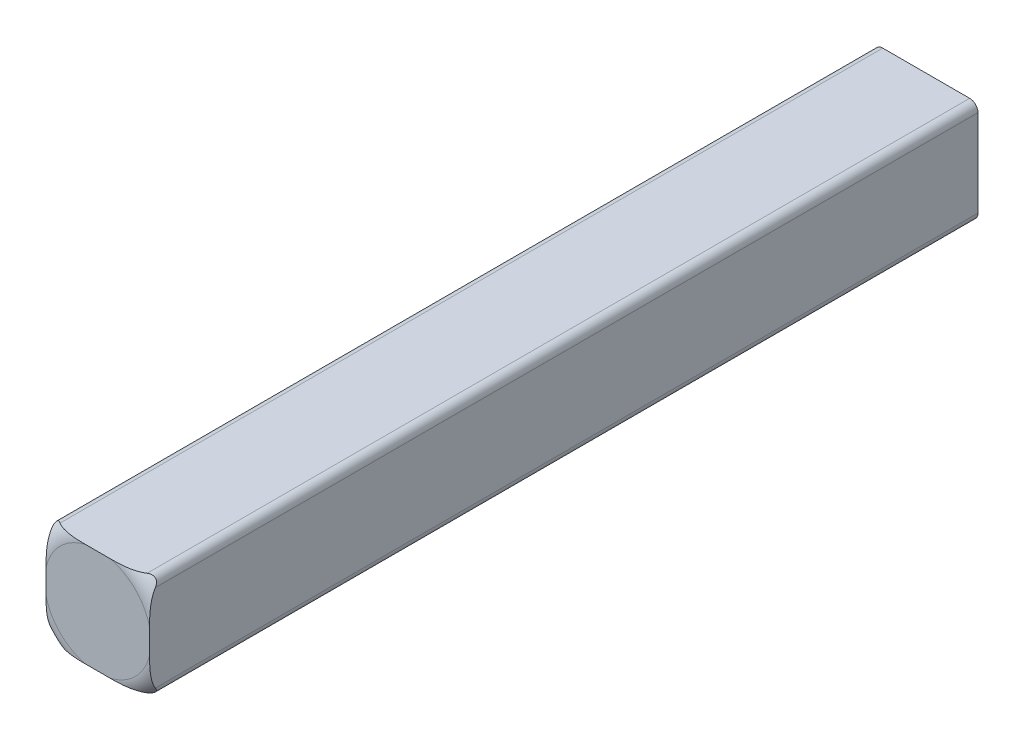
ISO-10303-21;
HEADER;
FILE_DESCRIPTION(('STEP AP214'),'2;1');
FILE_NAME('part.step','',(''),(''),'','','');
FILE_SCHEMA(('AUTOMOTIVE_DESIGN { 1 0 10303 214 1 1 1 1 }'));
ENDSEC;
DATA;
#1=APPLICATION_CONTEXT('core data for automotive mechanical design processes');
#2=APPLICATION_PROTOCOL_DEFINITION('international standard','automotive_design',2000,#1);
#3=PRODUCT_CONTEXT('',#1,'mechanical');
#4=PRODUCT('Part','Part','',(#3));
#5=PRODUCT_RELATED_PRODUCT_CATEGORY('part','',(#4));
#6=PRODUCT_DEFINITION_FORMATION('','',#4);
#7=PRODUCT_DEFINITION_CONTEXT('part definition',#1,'design');
#8=PRODUCT_DEFINITION('design','',#6,#7);
#9=PRODUCT_DEFINITION_SHAPE('','',#8);
#10=(LENGTH_UNIT() NAMED_UNIT(*) SI_UNIT(.MILLI.,.METRE.));
#11=(NAMED_UNIT(*) PLANE_ANGLE_UNIT() SI_UNIT($,.RADIAN.));
#12=(NAMED_UNIT(*) SI_UNIT($,.STERADIAN.) SOLID_ANGLE_UNIT());
#13=UNCERTAINTY_MEASURE_WITH_UNIT(LENGTH_MEASURE(1.E-05),#10,'distance_accuracy_value','');
#14=(GEOMETRIC_REPRESENTATION_CONTEXT(3) GLOBAL_UNCERTAINTY_ASSIGNED_CONTEXT((#13)) GLOBAL_UNIT_ASSIGNED_CONTEXT((#10,
#11,#12)) REPRESENTATION_CONTEXT('',''));
#15=CARTESIAN_POINT('',(0.,0.,0.));
#16=DIRECTION('',(0.,0.,1.));
#17=DIRECTION('',(1.,0.,0.));
#18=AXIS2_PLACEMENT_3D('',#15,#16,#17);
#19=CARTESIAN_POINT('',(-1.5875,1.5875,25.4));
#20=DIRECTION('',(0.,-1.,0.));
#21=DIRECTION('',(0.,0.,-1.));
#22=AXIS2_PLACEMENT_3D('',#19,#20,#21);
#23=PLANE('',#22);
#24=DIRECTION('',(1.,0.,0.));
#25=VECTOR('',#24,1.);
#26=CARTESIAN_POINT('',(-1.5875,1.5875,0.));
#27=LINE('',#26,#25);
#28=CARTESIAN_POINT('',(-1.33349999999988,1.5875,0.));
#29=VERTEX_POINT('',#28);
#30=CARTESIAN_POINT('',(1.33349999999988,1.5875,0.));
#31=VERTEX_POINT('',#30);
#32=EDGE_CURVE('E96',#29,#31,#27,.T.);
#33=ORIENTED_EDGE('',*,*,#32,.F.);
#34=DIRECTION('',(0.,0.,-1.));
#35=VECTOR('',#34,1.);
#36=CARTESIAN_POINT('',(-1.33350000000001,1.5875,25.4));
#37=LINE('',#36,#35);
#38=CARTESIAN_POINT('',(-1.33349999999976,1.58749999999933,25.2214993180163));
#39=VERTEX_POINT('',#38);
#40=EDGE_CURVE('E127',#39,#29,#37,.T.);
#41=ORIENTED_EDGE('',*,*,#40,.F.);
#42=CARTESIAN_POINT('',(-0.377876338243537,1.5875,25.4));
#43=CARTESIAN_POINT('',(-0.411612509119626,1.5875,25.3999933751559));
#44=CARTESIAN_POINT('',(-0.445352736805656,1.5875,25.3998557902654));
#45=CARTESIAN_POINT('',(-0.512942907948327,1.5875,25.3990478407271));
#46=CARTESIAN_POINT('',(-0.546792826939162,1.5875,25.3983756336304));
#47=CARTESIAN_POINT('',(-0.614509507764878,1.5875,25.3962226303108));
#48=CARTESIAN_POINT('',(-0.648376243547029,1.5875,25.3947408964801));
#49=CARTESIAN_POINT('',(-0.715189437993944,1.5875,25.3907056324485));
#50=CARTESIAN_POINT('',(-0.748137535690098,1.5875,25.3881801182269));
#51=CARTESIAN_POINT('',(-0.813874511250842,1.5875,25.3817497399492));
#52=CARTESIAN_POINT('',(-0.846663515341614,1.5875,25.3778462570928));
#53=CARTESIAN_POINT('',(-0.911972001446368,1.5875,25.3683282433345));
#54=CARTESIAN_POINT('',(-0.944491567482064,1.5875,25.3627142681786));
#55=CARTESIAN_POINT('',(-1.03884990510626,1.58750000000001,25.3432957352134));
#56=CARTESIAN_POINT('',(-1.10020590566776,1.58750000000004,25.326702751592));
#57=CARTESIAN_POINT('',(-1.17979261140478,1.58749999999999,25.297655047337));
#58=CARTESIAN_POINT('',(-1.19970518510336,1.58749999999997,25.2897223580693));
#59=CARTESIAN_POINT('',(-1.23899757921714,1.58750000000004,25.272570532428));
#60=CARTESIAN_POINT('',(-1.25837690634234,1.58750000000013,25.2633502498628));
#61=CARTESIAN_POINT('',(-1.29648737036626,1.58749999999987,25.243502020843));
#62=CARTESIAN_POINT('',(-1.31521592279952,1.58749999999952,25.232869126592));
#63=CARTESIAN_POINT('',(-1.3334999999995,1.58749999999867,25.2214993180167));
#64=B_SPLINE_CURVE_WITH_KNOTS('',3,(#42,#43,#44,#45,#46,#47,#48,#49,#50,#51,#52,#53,#54,#55,#56,
#57,#58,#59,#60,#61,#62,#63),.UNSPECIFIED.,.F.,.F.,(4,2,2,2,2,2,2,2,2,2,4),(0.,
0.101214578869633,0.202779489233488,0.304462283979966,0.403576841200485,0.502592332234144,
0.601575686961526,0.791402246158587,0.855672419606408,0.920000174261183,0.984559494506423),.UNSPECIFIED.);
#65=CARTESIAN_POINT('',(-0.377876338243537,1.5875,25.4));
#66=VERTEX_POINT('',#65);
#67=EDGE_CURVE('E88',#66,#39,#64,.T.);
#68=ORIENTED_EDGE('',*,*,#67,.F.);
#69=DIRECTION('',(-1.,0.,0.));
#70=VECTOR('',#69,1.);
#71=CARTESIAN_POINT('',(-1.5875,1.5875,25.4));
#72=LINE('',#71,#70);
#73=CARTESIAN_POINT('',(0.377876338243536,1.5875,25.4));
#74=VERTEX_POINT('',#73);
#75=EDGE_CURVE('E124',#66,#74,#72,.F.);
#76=ORIENTED_EDGE('',*,*,#75,.T.);
#77=CARTESIAN_POINT('',(1.3335,1.5875,25.2214993180159));
#78=CARTESIAN_POINT('',(1.31039310118339,1.5875,25.2358652995629));
#79=CARTESIAN_POINT('',(1.2865956642968,1.5875,25.2490482576007));
#80=CARTESIAN_POINT('',(1.23796868030271,1.5875,25.2732235603891));
#81=CARTESIAN_POINT('',(1.21314134560692,1.5875,25.284220334021));
#82=CARTESIAN_POINT('',(1.13821413543874,1.5875,25.313985593762));
#83=CARTESIAN_POINT('',(1.08698851455542,1.5875,25.3299288510369));
#84=CARTESIAN_POINT('',(0.999962751237763,1.5875,25.3515855860613));
#85=CARTESIAN_POINT('',(0.964535612837992,1.5875,25.3589398885291));
#86=CARTESIAN_POINT('',(0.893247688923865,1.5875,25.3713838801317));
#87=CARTESIAN_POINT('',(0.857386498395726,1.5875,25.3764712545345));
#88=CARTESIAN_POINT('',(0.785399533338706,1.5875,25.3848313870659));
#89=CARTESIAN_POINT('',(0.749273402082695,1.5875,25.3881009072115));
#90=CARTESIAN_POINT('',(0.675801730227447,1.5875,25.3933189638327));
#91=CARTESIAN_POINT('',(0.638453184386328,1.5875,25.3952232897935));
#92=CARTESIAN_POINT('',(0.563797247200004,1.5875,25.3979718892388));
#93=CARTESIAN_POINT('',(0.526489923948468,1.5875,25.3988182849851));
#94=CARTESIAN_POINT('',(0.452078339022183,1.5875,25.3998256272711));
#95=CARTESIAN_POINT('',(0.414974136365072,1.5875,25.3999904665671));
#96=CARTESIAN_POINT('',(0.377876338243536,1.5875,25.4));
#97=B_SPLINE_CURVE_WITH_KNOTS('',3,(#77,#78,#79,#80,#81,#82,#83,#84,#85,#86,#87,#88,#89,#90,#91,
#92,#93,#94,#95,#96),.UNSPECIFIED.,.F.,.F.,(4,2,2,2,2,2,2,2,2,4),(0.,0.0815326247959326,
0.162898354774419,0.323290286001704,0.431774886900757,0.540370007655983,0.649157944635816,
0.761326732026148,0.873270140095043,0.984573284944613),.UNSPECIFIED.);
#98=CARTESIAN_POINT('',(1.3335,1.5875,25.2214993180159));
#99=VERTEX_POINT('',#98);
#100=EDGE_CURVE('E168',#99,#74,#97,.T.);
#101=ORIENTED_EDGE('',*,*,#100,.F.);
#102=DIRECTION('',(0.,0.,-1.));
#103=VECTOR('',#102,1.);
#104=CARTESIAN_POINT('',(1.33350000000001,1.5875,25.4));
#105=LINE('',#104,#103);
#106=EDGE_CURVE('E167',#31,#99,#105,.F.);
#107=ORIENTED_EDGE('',*,*,#106,.F.);
#108=EDGE_LOOP('',(#33,#41,#68,#76,#101,#107));
#109=FACE_BOUND('',#108,.T.);
#110=ADVANCED_FACE('F34',(#109),#23,.F.);
#111=CARTESIAN_POINT('',(1.3335,1.3335,25.4));
#112=DIRECTION('',(0.,0.,-1.));
#113=DIRECTION('',(-1.,0.,0.));
#114=AXIS2_PLACEMENT_3D('',#111,#112,#113);
#115=CYLINDRICAL_SURFACE('',#114,0.254);
#116=DIRECTION('',(0.,0.,1.));
#117=VECTOR('',#116,1.);
#118=CARTESIAN_POINT('',(1.5875,1.33350000000001,25.4));
#119=LINE('',#118,#117);
#120=CARTESIAN_POINT('',(1.58749999999933,1.33349999999975,25.2214993180163));
#121=VERTEX_POINT('',#120);
#122=CARTESIAN_POINT('',(1.5875,1.33349999999988,0.));
#123=VERTEX_POINT('',#122);
#124=EDGE_CURVE('E490',#121,#123,#119,.F.);
#125=ORIENTED_EDGE('',*,*,#124,.T.);
#126=CARTESIAN_POINT('',(1.3335,1.3335,0.));
#127=DIRECTION('',(0.,0.,-1.));
#128=DIRECTION('',(-1.,0.,0.));
#129=AXIS2_PLACEMENT_3D('',#126,#127,#128);
#130=CIRCLE('',#129,0.254);
#131=EDGE_CURVE('E495',#123,#31,#130,.F.);
#132=ORIENTED_EDGE('',*,*,#131,.T.);
#133=ORIENTED_EDGE('',*,*,#106,.T.);
#134=CARTESIAN_POINT('',(1.3335,1.5875,25.2214993180159));
#135=CARTESIAN_POINT('',(1.34690792462913,1.58748566897288,25.2131902383444));
#136=CARTESIAN_POINT('',(1.36046268636274,1.58643563491714,25.2049732030893));
#137=CARTESIAN_POINT('',(1.38783838491251,1.58201648662521,25.1892469870888));
#138=CARTESIAN_POINT('',(1.40166046367848,1.57861670279278,25.1817486789985));
#139=CARTESIAN_POINT('',(1.42521880461481,1.57058714220896,25.1701813537226));
#140=CARTESIAN_POINT('',(1.43498690476737,1.56659229292943,25.1657462781291));
#141=CARTESIAN_POINT('',(1.45425932377618,1.55721249958346,25.1580014330523));
#142=CARTESIAN_POINT('',(1.46376466264463,1.55183414419047,25.1546864976667));
#143=CARTESIAN_POINT('',(1.48078992954893,1.54064277647373,25.1499494031102));
#144=CARTESIAN_POINT('',(1.48838416094885,1.53503704758616,25.1483092418591));
#145=CARTESIAN_POINT('',(1.50299443314631,1.52291375209377,25.1462529778718));
#146=CARTESIAN_POINT('',(1.51001060875297,1.51639639905189,25.1458365889481));
#147=CARTESIAN_POINT('',(1.52324184577942,1.50263078678935,25.1462804295973));
#148=CARTESIAN_POINT('',(1.52945667397997,1.49538231587763,25.1471410299099));
#149=CARTESIAN_POINT('',(1.54093535352862,1.48038761855588,25.1500339763629));
#150=CARTESIAN_POINT('',(1.54619862694723,1.47264109349685,25.1520670314777));
#151=CARTESIAN_POINT('',(1.5571701281181,1.45446300659162,25.157864814596));
#152=CARTESIAN_POINT('',(1.56252875091595,1.44392996611573,25.161967806468));
#153=CARTESIAN_POINT('',(1.57162418246107,1.42264994892329,25.1713367713514));
#154=CARTESIAN_POINT('',(1.57535394035416,1.41190224866778,25.1766076544231));
#155=CARTESIAN_POINT('',(1.58147222213898,1.38976321513482,25.1882192454684));
#156=CARTESIAN_POINT('',(1.58376977522872,1.37837092259128,25.1946044346479));
#157=CARTESIAN_POINT('',(1.58677095199112,1.35579141019531,25.2078013248425));
#158=CARTESIAN_POINT('',(1.58749208945789,1.34460332096515,25.2146074664251));
#159=CARTESIAN_POINT('',(1.5875,1.33350000000001,25.2214993180159));
#160=B_SPLINE_CURVE_WITH_KNOTS('',3,(#134,#135,#136,#137,#138,#139,#140,#141,#142,#143,#144,
#145,#146,#147,#148,#149,#150,#151,#152,#153,#154,#155,#156,#157,#158,#159),.UNSPECIFIED.,.F.,
.F.,(4,2,2,2,2,2,2,2,2,2,2,2,4),(0.,0.0474135575383169,0.0954579548320223,0.129685196647709,
0.163752362077401,0.192367952546184,0.220976850534823,0.249594055978005,0.278228584196804,
0.31555199042672,0.353035394369279,0.392706187180641,0.431933953270492),.UNSPECIFIED.);
#161=EDGE_CURVE('E154',#99,#121,#160,.T.);
#162=ORIENTED_EDGE('',*,*,#161,.T.);
#163=EDGE_LOOP('',(#125,#132,#133,#162));
#164=FACE_BOUND('',#163,.T.);
#165=ADVANCED_FACE('F170',(#164),#115,.T.);
#166=CARTESIAN_POINT('',(-1.3335,1.3335,25.4));
#167=DIRECTION('',(0.,0.,-1.));
#168=DIRECTION('',(-1.,0.,0.));
#169=AXIS2_PLACEMENT_3D('',#166,#167,#168);
#170=CYLINDRICAL_SURFACE('',#169,0.254);
#171=ORIENTED_EDGE('',*,*,#40,.T.);
#172=CARTESIAN_POINT('',(-1.3335,1.3335,0.));
#173=DIRECTION('',(0.,0.,-1.));
#174=DIRECTION('',(-1.,0.,0.));
#175=AXIS2_PLACEMENT_3D('',#172,#173,#174);
#176=CIRCLE('',#175,0.254);
#177=CARTESIAN_POINT('',(-1.5875,1.33349999999988,0.));
#178=VERTEX_POINT('',#177);
#179=EDGE_CURVE('E507',#29,#178,#176,.F.);
#180=ORIENTED_EDGE('',*,*,#179,.T.);
#181=DIRECTION('',(0.,0.,-1.));
#182=VECTOR('',#181,1.);
#183=CARTESIAN_POINT('',(-1.5875,1.33350000000001,25.4));
#184=LINE('',#183,#182);
#185=CARTESIAN_POINT('',(-1.5875,1.3335,25.2214993180159));
#186=VERTEX_POINT('',#185);
#187=EDGE_CURVE('E488',#178,#186,#184,.F.);
#188=ORIENTED_EDGE('',*,*,#187,.T.);
#189=CARTESIAN_POINT('',(-1.33350000000001,1.5875,25.2214993180159));
#190=CARTESIAN_POINT('',(-1.34690792462914,1.58748566897288,25.2131902383444));
#191=CARTESIAN_POINT('',(-1.36046268636275,1.58643563491714,25.2049732030893));
#192=CARTESIAN_POINT('',(-1.38783838491252,1.5820164866252,25.1892469870888));
#193=CARTESIAN_POINT('',(-1.40166046367848,1.57861670279278,25.1817486789985));
#194=CARTESIAN_POINT('',(-1.42521880461481,1.57058714220896,25.1701813537226));
#195=CARTESIAN_POINT('',(-1.43498690476738,1.56659229292943,25.1657462781291));
#196=CARTESIAN_POINT('',(-1.45425932377619,1.55721249958346,25.1580014330523));
#197=CARTESIAN_POINT('',(-1.46376466264463,1.55183414419047,25.1546864976667));
#198=CARTESIAN_POINT('',(-1.48078992954894,1.54064277647373,25.1499494031102));
#199=CARTESIAN_POINT('',(-1.48838416094885,1.53503704758616,25.1483092418591));
#200=CARTESIAN_POINT('',(-1.50299443314631,1.52291375209376,25.1462529778718));
#201=CARTESIAN_POINT('',(-1.51001060875298,1.51639639905189,25.1458365889481));
#202=CARTESIAN_POINT('',(-1.52324184577942,1.50263078678935,25.1462804295973));
#203=CARTESIAN_POINT('',(-1.52945667397998,1.49538231587763,25.1471410299099));
#204=CARTESIAN_POINT('',(-1.54093535352863,1.48038761855587,25.1500339763629));
#205=CARTESIAN_POINT('',(-1.54619862694723,1.47264109349684,25.1520670314777));
#206=CARTESIAN_POINT('',(-1.5571701281181,1.45446300659162,25.157864814596));
#207=CARTESIAN_POINT('',(-1.56252875091595,1.44392996611573,25.161967806468));
#208=CARTESIAN_POINT('',(-1.57162418246107,1.42264994892329,25.1713367713514));
#209=CARTESIAN_POINT('',(-1.57535394035416,1.41190224866778,25.1766076544231));
#210=CARTESIAN_POINT('',(-1.58147222213898,1.38976321513481,25.1882192454684));
#211=CARTESIAN_POINT('',(-1.58376977522872,1.37837092259127,25.1946044346479));
#212=CARTESIAN_POINT('',(-1.58677095199112,1.35579141019531,25.2078013248425));
#213=CARTESIAN_POINT('',(-1.58749208945789,1.34460332096514,25.2146074664251));
#214=CARTESIAN_POINT('',(-1.5875,1.3335,25.2214993180159));
#215=B_SPLINE_CURVE_WITH_KNOTS('',3,(#189,#190,#191,#192,#193,#194,#195,#196,#197,#198,#199,
#200,#201,#202,#203,#204,#205,#206,#207,#208,#209,#210,#211,#212,#213,#214),.UNSPECIFIED.,.F.,
.F.,(4,2,2,2,2,2,2,2,2,2,2,2,4),(0.,0.0474135575383122,0.0954579548320149,0.129685196647703,
0.163752362077395,0.192367952546178,0.220976850534816,0.249594055977996,0.278228584196794,
0.315551990426708,0.353035394369269,0.392706187180634,0.431933953270492),.UNSPECIFIED.);
#216=EDGE_CURVE('E129',#39,#186,#215,.T.);
#217=ORIENTED_EDGE('',*,*,#216,.F.);
#218=EDGE_LOOP('',(#171,#180,#188,#217));
#219=FACE_BOUND('',#218,.T.);
#220=ADVANCED_FACE('F313',(#219),#170,.T.);
#221=CARTESIAN_POINT('',(1.5875,-1.5875,25.4));
#222=DIRECTION('',(-1.,0.,0.));
#223=DIRECTION('',(0.,0.,1.));
#224=AXIS2_PLACEMENT_3D('',#221,#222,#223);
#225=PLANE('',#224);
#226=DIRECTION('',(0.,-1.,0.));
#227=VECTOR('',#226,1.);
#228=CARTESIAN_POINT('',(1.5875,-1.5875,0.));
#229=LINE('',#228,#227);
#230=CARTESIAN_POINT('',(1.5875,-1.33349999999988,0.));
#231=VERTEX_POINT('',#230);
#232=EDGE_CURVE('E508',#123,#231,#229,.T.);
#233=ORIENTED_EDGE('',*,*,#232,.F.);
#234=ORIENTED_EDGE('',*,*,#124,.F.);
#235=CARTESIAN_POINT('',(1.5875,0.377876338243537,25.4));
#236=CARTESIAN_POINT('',(1.5875,0.411612509119626,25.3999933751559));
#237=CARTESIAN_POINT('',(1.5875,0.445352736805657,25.3998557902654));
#238=CARTESIAN_POINT('',(1.5875,0.512942907948327,25.3990478407271));
#239=CARTESIAN_POINT('',(1.5875,0.546792826939163,25.3983756336304));
#240=CARTESIAN_POINT('',(1.5875,0.614509507764879,25.3962226303108));
#241=CARTESIAN_POINT('',(1.5875,0.64837624354703,25.3947408964801));
#242=CARTESIAN_POINT('',(1.5875,0.715189437993945,25.3907056324485));
#243=CARTESIAN_POINT('',(1.5875,0.7481375356901,25.3881801182269));
#244=CARTESIAN_POINT('',(1.5875,0.813874511250844,25.3817497399492));
#245=CARTESIAN_POINT('',(1.5875,0.846663515341615,25.3778462570928));
#246=CARTESIAN_POINT('',(1.5875,0.91197200144637,25.3683282433344));
#247=CARTESIAN_POINT('',(1.5875,0.944491567482066,25.3627142681786));
#248=CARTESIAN_POINT('',(1.58750000000001,1.03884990510626,25.3432957352134));
#249=CARTESIAN_POINT('',(1.58750000000004,1.10020590566776,25.326702751592));
#250=CARTESIAN_POINT('',(1.58749999999999,1.17979261140478,25.297655047337));
#251=CARTESIAN_POINT('',(1.58749999999997,1.19970518510336,25.2897223580693));
#252=CARTESIAN_POINT('',(1.58750000000004,1.23899757921714,25.272570532428));
#253=CARTESIAN_POINT('',(1.58750000000013,1.25837690634234,25.2633502498628));
#254=CARTESIAN_POINT('',(1.58749999999987,1.29648737036626,25.243502020843));
#255=CARTESIAN_POINT('',(1.58749999999952,1.31521592279952,25.232869126592));
#256=CARTESIAN_POINT('',(1.58749999999867,1.3334999999995,25.2214993180167));
#257=B_SPLINE_CURVE_WITH_KNOTS('',3,(#235,#236,#237,#238,#239,#240,#241,#242,#243,#244,#245,
#246,#247,#248,#249,#250,#251,#252,#253,#254,#255,#256),.UNSPECIFIED.,.F.,.F.,(4,2,2,2,2,2,2,2,
2,2,4),(0.,0.101214578869634,0.202779489233488,0.304462283979967,0.403576841200486,
0.502592332234146,0.601575686961527,0.791402246158587,0.855672419606407,0.920000174261181,
0.984559494506421),.UNSPECIFIED.);
#258=CARTESIAN_POINT('',(1.5875,0.377876338243537,25.4));
#259=VERTEX_POINT('',#258);
#260=EDGE_CURVE('E59',#259,#121,#257,.T.);
#261=ORIENTED_EDGE('',*,*,#260,.F.);
#262=DIRECTION('',(0.,1.,0.));
#263=VECTOR('',#262,1.);
#264=CARTESIAN_POINT('',(1.5875,1.5875,25.4));
#265=LINE('',#264,#263);
#266=CARTESIAN_POINT('',(1.5875,-0.377876338243537,25.4));
#267=VERTEX_POINT('',#266);
#268=EDGE_CURVE('E142',#259,#267,#265,.F.);
#269=ORIENTED_EDGE('',*,*,#268,.T.);
#270=CARTESIAN_POINT('',(1.5875,-1.3335,25.2214993180159));
#271=CARTESIAN_POINT('',(1.5875,-1.31039310118339,25.2358652995629));
#272=CARTESIAN_POINT('',(1.5875,-1.2865956642968,25.2490482576007));
#273=CARTESIAN_POINT('',(1.5875,-1.23796868030272,25.2732235603891));
#274=CARTESIAN_POINT('',(1.5875,-1.21314134560692,25.284220334021));
#275=CARTESIAN_POINT('',(1.5875,-1.13821413543874,25.313985593762));
#276=CARTESIAN_POINT('',(1.5875,-1.08698851455542,25.3299288510369));
#277=CARTESIAN_POINT('',(1.5875,-0.999962751237764,25.3515855860613));
#278=CARTESIAN_POINT('',(1.5875,-0.964535612837993,25.3589398885291));
#279=CARTESIAN_POINT('',(1.5875,-0.893247688923866,25.3713838801317));
#280=CARTESIAN_POINT('',(1.5875,-0.857386498395727,25.3764712545345));
#281=CARTESIAN_POINT('',(1.5875,-0.785399533338706,25.3848313870659));
#282=CARTESIAN_POINT('',(1.5875,-0.749273402082695,25.3881009072115));
#283=CARTESIAN_POINT('',(1.5875,-0.675801730227447,25.3933189638327));
#284=CARTESIAN_POINT('',(1.5875,-0.638453184386328,25.3952232897935));
#285=CARTESIAN_POINT('',(1.5875,-0.563797247200004,25.3979718892388));
#286=CARTESIAN_POINT('',(1.5875,-0.526489923948468,25.3988182849851));
#287=CARTESIAN_POINT('',(1.5875,-0.452078339022183,25.3998256272711));
#288=CARTESIAN_POINT('',(1.5875,-0.414974136365072,25.3999904665671));
#289=CARTESIAN_POINT('',(1.5875,-0.377876338243536,25.4));
#290=B_SPLINE_CURVE_WITH_KNOTS('',3,(#270,#271,#272,#273,#274,#275,#276,#277,#278,#279,#280,
#281,#282,#283,#284,#285,#286,#287,#288,#289),.UNSPECIFIED.,.F.,.F.,(4,2,2,2,2,2,2,2,2,4),(0.,
0.0815326247959322,0.162898354774419,0.323290286001703,0.431774886900756,0.540370007655983,
0.649157944635815,0.761326732026148,0.873270140095043,0.984573284944614),.UNSPECIFIED.);
#291=CARTESIAN_POINT('',(1.5875,-1.3335,25.2214993180159));
#292=VERTEX_POINT('',#291);
#293=EDGE_CURVE('E424',#292,#267,#290,.T.);
#294=ORIENTED_EDGE('',*,*,#293,.F.);
#295=DIRECTION('',(0.,0.,-1.));
#296=VECTOR('',#295,1.);
#297=CARTESIAN_POINT('',(1.5875,-1.33350000000001,25.4));
#298=LINE('',#297,#296);
#299=EDGE_CURVE('E475',#231,#292,#298,.F.);
#300=ORIENTED_EDGE('',*,*,#299,.F.);
#301=EDGE_LOOP('',(#233,#234,#261,#269,#294,#300));
#302=FACE_BOUND('',#301,.T.);
#303=ADVANCED_FACE('F294',(#302),#225,.F.);
#304=CARTESIAN_POINT('',(-1.5875,-1.5875,25.4));
#305=DIRECTION('',(1.,0.,0.));
#306=DIRECTION('',(0.,0.,-1.));
#307=AXIS2_PLACEMENT_3D('',#304,#305,#306);
#308=PLANE('',#307);
#309=DIRECTION('',(0.,1.,0.));
#310=VECTOR('',#309,1.);
#311=CARTESIAN_POINT('',(-1.5875,-1.5875,0.));
#312=LINE('',#311,#310);
#313=CARTESIAN_POINT('',(-1.5875,-1.3335,0.));
#314=VERTEX_POINT('',#313);
#315=EDGE_CURVE('E472',#314,#178,#312,.T.);
#316=ORIENTED_EDGE('',*,*,#315,.F.);
#317=DIRECTION('',(0.,0.,-1.));
#318=VECTOR('',#317,1.);
#319=CARTESIAN_POINT('',(-1.5875,-1.3335,25.4));
#320=LINE('',#319,#318);
#321=CARTESIAN_POINT('',(-1.58749999999933,-1.33349999999975,25.2214993180163));
#322=VERTEX_POINT('',#321);
#323=EDGE_CURVE('E468',#322,#314,#320,.T.);
#324=ORIENTED_EDGE('',*,*,#323,.F.);
#325=CARTESIAN_POINT('',(-1.5875,-0.377876338243537,25.4));
#326=CARTESIAN_POINT('',(-1.5875,-0.411612509119626,25.3999933751559));
#327=CARTESIAN_POINT('',(-1.5875,-0.445352736805657,25.3998557902654));
#328=CARTESIAN_POINT('',(-1.5875,-0.512942907948327,25.3990478407271));
#329=CARTESIAN_POINT('',(-1.5875,-0.546792826939162,25.3983756336304));
#330=CARTESIAN_POINT('',(-1.5875,-0.614509507764879,25.3962226303108));
#331=CARTESIAN_POINT('',(-1.5875,-0.64837624354703,25.3947408964801));
#332=CARTESIAN_POINT('',(-1.5875,-0.715189437993945,25.3907056324485));
#333=CARTESIAN_POINT('',(-1.5875,-0.748137535690099,25.3881801182269));
#334=CARTESIAN_POINT('',(-1.5875,-0.813874511250844,25.3817497399492));
#335=CARTESIAN_POINT('',(-1.5875,-0.846663515341616,25.3778462570928));
#336=CARTESIAN_POINT('',(-1.5875,-0.911972001446371,25.3683282433344));
#337=CARTESIAN_POINT('',(-1.5875,-0.944491567482067,25.3627142681786));
#338=CARTESIAN_POINT('',(-1.58750000000001,-1.03884990510626,25.3432957352134));
#339=CARTESIAN_POINT('',(-1.58750000000004,-1.10020590566776,25.326702751592));
#340=CARTESIAN_POINT('',(-1.58749999999999,-1.17979261140478,25.297655047337));
#341=CARTESIAN_POINT('',(-1.58749999999997,-1.19970518510335,25.2897223580693));
#342=CARTESIAN_POINT('',(-1.58750000000004,-1.23899757921714,25.272570532428));
#343=CARTESIAN_POINT('',(-1.58750000000013,-1.25837690634234,25.2633502498628));
#344=CARTESIAN_POINT('',(-1.58749999999987,-1.29648737036626,25.243502020843));
#345=CARTESIAN_POINT('',(-1.58749999999952,-1.31521592279951,25.232869126592));
#346=CARTESIAN_POINT('',(-1.58749999999867,-1.3334999999995,25.2214993180167));
#347=B_SPLINE_CURVE_WITH_KNOTS('',3,(#325,#326,#327,#328,#329,#330,#331,#332,#333,#334,#335,
#336,#337,#338,#339,#340,#341,#342,#343,#344,#345,#346),.UNSPECIFIED.,.F.,.F.,(4,2,2,2,2,2,2,2,
2,2,4),(0.,0.101214578869633,0.202779489233488,0.304462283979967,0.403576841200486,
0.502592332234147,0.601575686961528,0.791402246158588,0.855672419606404,0.920000174261181,
0.984559494506417),.UNSPECIFIED.);
#348=CARTESIAN_POINT('',(-1.5875,-0.377876338243537,25.4));
#349=VERTEX_POINT('',#348);
#350=EDGE_CURVE('E147',#349,#322,#347,.T.);
#351=ORIENTED_EDGE('',*,*,#350,.F.);
#352=DIRECTION('',(0.,1.,0.));
#353=VECTOR('',#352,1.);
#354=CARTESIAN_POINT('',(-1.5875,1.5875,25.4));
#355=LINE('',#354,#353);
#356=CARTESIAN_POINT('',(-1.5875,0.377876338243537,25.4));
#357=VERTEX_POINT('',#356);
#358=EDGE_CURVE('E227',#349,#357,#355,.T.);
#359=ORIENTED_EDGE('',*,*,#358,.T.);
#360=CARTESIAN_POINT('',(-1.5875,1.3335,25.2214993180159));
#361=CARTESIAN_POINT('',(-1.5875,1.31039310118339,25.2358652995629));
#362=CARTESIAN_POINT('',(-1.5875,1.2865956642968,25.2490482576007));
#363=CARTESIAN_POINT('',(-1.5875,1.23796868030272,25.2732235603891));
#364=CARTESIAN_POINT('',(-1.5875,1.21314134560692,25.284220334021));
#365=CARTESIAN_POINT('',(-1.5875,1.13821413543874,25.313985593762));
#366=CARTESIAN_POINT('',(-1.58749999999999,1.08698851455542,25.3299288510369));
#367=CARTESIAN_POINT('',(-1.5875,0.999962751237764,25.3515855860613));
#368=CARTESIAN_POINT('',(-1.5875,0.964535612837993,25.3589398885291));
#369=CARTESIAN_POINT('',(-1.5875,0.893247688923866,25.3713838801317));
#370=CARTESIAN_POINT('',(-1.5875,0.857386498395727,25.3764712545345));
#371=CARTESIAN_POINT('',(-1.5875,0.785399533338707,25.3848313870659));
#372=CARTESIAN_POINT('',(-1.5875,0.749273402082695,25.3881009072115));
#373=CARTESIAN_POINT('',(-1.5875,0.675801730227448,25.3933189638327));
#374=CARTESIAN_POINT('',(-1.5875,0.638453184386328,25.3952232897935));
#375=CARTESIAN_POINT('',(-1.5875,0.563797247200004,25.3979718892388));
#376=CARTESIAN_POINT('',(-1.5875,0.526489923948468,25.3988182849851));
#377=CARTESIAN_POINT('',(-1.5875,0.452078339022183,25.3998256272711));
#378=CARTESIAN_POINT('',(-1.5875,0.414974136365072,25.3999904665671));
#379=CARTESIAN_POINT('',(-1.5875,0.377876338243537,25.4));
#380=B_SPLINE_CURVE_WITH_KNOTS('',3,(#360,#361,#362,#363,#364,#365,#366,#367,#368,#369,#370,
#371,#372,#373,#374,#375,#376,#377,#378,#379),.UNSPECIFIED.,.F.,.F.,(4,2,2,2,2,2,2,2,2,4),(0.,
0.0815326247959322,0.162898354774419,0.323290286001703,0.431774886900756,0.540370007655982,
0.649157944635815,0.761326732026148,0.873270140095042,0.984573284944613),.UNSPECIFIED.);
#381=EDGE_CURVE('E146',#186,#357,#380,.T.);
#382=ORIENTED_EDGE('',*,*,#381,.F.);
#383=ORIENTED_EDGE('',*,*,#187,.F.);
#384=EDGE_LOOP('',(#316,#324,#351,#359,#382,#383));
#385=FACE_BOUND('',#384,.T.);
#386=ADVANCED_FACE('F288',(#385),#308,.F.);
#387=CARTESIAN_POINT('',(1.3335,-1.3335,25.4));
#388=DIRECTION('',(0.,0.,-1.));
#389=DIRECTION('',(-1.,0.,0.));
#390=AXIS2_PLACEMENT_3D('',#387,#388,#389);
#391=CYLINDRICAL_SURFACE('',#390,0.254);
#392=DIRECTION('',(0.,0.,1.));
#393=VECTOR('',#392,1.);
#394=CARTESIAN_POINT('',(1.33350000000001,-1.5875,25.4));
#395=LINE('',#394,#393);
#396=CARTESIAN_POINT('',(1.33349999999976,-1.58749999999933,25.2214993180163));
#397=VERTEX_POINT('',#396);
#398=CARTESIAN_POINT('',(1.33350000000001,-1.5875,0.));
#399=VERTEX_POINT('',#398);
#400=EDGE_CURVE('E474',#397,#399,#395,.F.);
#401=ORIENTED_EDGE('',*,*,#400,.T.);
#402=CARTESIAN_POINT('',(1.3335,-1.3335,0.));
#403=DIRECTION('',(0.,0.,-1.));
#404=DIRECTION('',(-1.,0.,0.));
#405=AXIS2_PLACEMENT_3D('',#402,#403,#404);
#406=CIRCLE('',#405,0.254);
#407=EDGE_CURVE('E50',#399,#231,#406,.F.);
#408=ORIENTED_EDGE('',*,*,#407,.T.);
#409=ORIENTED_EDGE('',*,*,#299,.T.);
#410=CARTESIAN_POINT('',(1.33350000000001,-1.5875,25.2214993180159));
#411=CARTESIAN_POINT('',(1.34690792462914,-1.58748566897288,25.2131902383444));
#412=CARTESIAN_POINT('',(1.36046268636275,-1.58643563491714,25.2049732030893));
#413=CARTESIAN_POINT('',(1.38783838491252,-1.58201648662521,25.1892469870888));
#414=CARTESIAN_POINT('',(1.40166046367848,-1.57861670279278,25.1817486789985));
#415=CARTESIAN_POINT('',(1.42521880461481,-1.57058714220896,25.1701813537226));
#416=CARTESIAN_POINT('',(1.43498690476738,-1.56659229292943,25.1657462781291));
#417=CARTESIAN_POINT('',(1.45425932377619,-1.55721249958346,25.1580014330523));
#418=CARTESIAN_POINT('',(1.46376466264463,-1.55183414419047,25.1546864976667));
#419=CARTESIAN_POINT('',(1.48078992954893,-1.54064277647373,25.1499494031102));
#420=CARTESIAN_POINT('',(1.48838416094885,-1.53503704758616,25.1483092418591));
#421=CARTESIAN_POINT('',(1.50299443314631,-1.52291375209376,25.1462529778718));
#422=CARTESIAN_POINT('',(1.51001060875298,-1.51639639905189,25.1458365889481));
#423=CARTESIAN_POINT('',(1.52324184577942,-1.50263078678935,25.1462804295973));
#424=CARTESIAN_POINT('',(1.52945667397997,-1.49538231587763,25.1471410299099));
#425=CARTESIAN_POINT('',(1.54093535352863,-1.48038761855588,25.1500339763629));
#426=CARTESIAN_POINT('',(1.54619862694723,-1.47264109349684,25.1520670314777));
#427=CARTESIAN_POINT('',(1.5571701281181,-1.45446300659162,25.157864814596));
#428=CARTESIAN_POINT('',(1.56252875091595,-1.44392996611573,25.161967806468));
#429=CARTESIAN_POINT('',(1.57162418246107,-1.42264994892329,25.1713367713514));
#430=CARTESIAN_POINT('',(1.57535394035416,-1.41190224866778,25.1766076544231));
#431=CARTESIAN_POINT('',(1.58147222213898,-1.38976321513481,25.1882192454684));
#432=CARTESIAN_POINT('',(1.58376977522872,-1.37837092259127,25.1946044346479));
#433=CARTESIAN_POINT('',(1.58677095199112,-1.35579141019531,25.2078013248425));
#434=CARTESIAN_POINT('',(1.58749208945789,-1.34460332096514,25.2146074664251));
#435=CARTESIAN_POINT('',(1.5875,-1.3335,25.2214993180159));
#436=B_SPLINE_CURVE_WITH_KNOTS('',3,(#410,#411,#412,#413,#414,#415,#416,#417,#418,#419,#420,
#421,#422,#423,#424,#425,#426,#427,#428,#429,#430,#431,#432,#433,#434,#435),.UNSPECIFIED.,.F.,
.F.,(4,2,2,2,2,2,2,2,2,2,2,2,4),(0.,0.0474135575383107,0.0954579548320146,0.129685196647703,
0.163752362077395,0.192367952546177,0.220976850534815,0.249594055977996,0.278228584196793,
0.315551990426708,0.353035394369268,0.392706187180634,0.431933953270491),.UNSPECIFIED.);
#437=EDGE_CURVE('E434',#397,#292,#436,.T.);
#438=ORIENTED_EDGE('',*,*,#437,.F.);
#439=EDGE_LOOP('',(#401,#408,#409,#438));
#440=FACE_BOUND('',#439,.T.);
#441=ADVANCED_FACE('F293',(#440),#391,.T.);
#442=CARTESIAN_POINT('',(-1.3335,-1.3335,25.4));
#443=DIRECTION('',(0.,0.,-1.));
#444=DIRECTION('',(-1.,0.,0.));
#445=AXIS2_PLACEMENT_3D('',#442,#443,#444);
#446=CYLINDRICAL_SURFACE('',#445,0.254);
#447=ORIENTED_EDGE('',*,*,#323,.T.);
#448=CARTESIAN_POINT('',(-1.3335,-1.3335,0.));
#449=DIRECTION('',(0.,0.,-1.));
#450=DIRECTION('',(-1.,0.,0.));
#451=AXIS2_PLACEMENT_3D('',#448,#449,#450);
#452=CIRCLE('',#451,0.254);
#453=CARTESIAN_POINT('',(-1.33349999999988,-1.5875,0.));
#454=VERTEX_POINT('',#453);
#455=EDGE_CURVE('E480',#314,#454,#452,.F.);
#456=ORIENTED_EDGE('',*,*,#455,.T.);
#457=DIRECTION('',(0.,0.,1.));
#458=VECTOR('',#457,1.);
#459=CARTESIAN_POINT('',(-1.33350000000001,-1.5875,25.4));
#460=LINE('',#459,#458);
#461=CARTESIAN_POINT('',(-1.3335,-1.5875,25.2214993180159));
#462=VERTEX_POINT('',#461);
#463=EDGE_CURVE('E44',#454,#462,#460,.T.);
#464=ORIENTED_EDGE('',*,*,#463,.T.);
#465=CARTESIAN_POINT('',(-1.5875,-1.33350000000001,25.2214993180159));
#466=CARTESIAN_POINT('',(-1.58748566897288,-1.34690792462913,25.2131902383444));
#467=CARTESIAN_POINT('',(-1.58643563491714,-1.36046268636275,25.2049732030893));
#468=CARTESIAN_POINT('',(-1.58201648662521,-1.38783838491251,25.1892469870888));
#469=CARTESIAN_POINT('',(-1.57861670279278,-1.40166046367848,25.1817486789985));
#470=CARTESIAN_POINT('',(-1.57058714220896,-1.42521880461481,25.1701813537226));
#471=CARTESIAN_POINT('',(-1.56659229292943,-1.43498690476737,25.1657462781291));
#472=CARTESIAN_POINT('',(-1.55721249958346,-1.45425932377618,25.1580014330523));
#473=CARTESIAN_POINT('',(-1.55183414419047,-1.46376466264463,25.1546864976667));
#474=CARTESIAN_POINT('',(-1.54064277647373,-1.48078992954893,25.1499494031102));
#475=CARTESIAN_POINT('',(-1.53503704758616,-1.48838416094885,25.1483092418591));
#476=CARTESIAN_POINT('',(-1.52291375209376,-1.50299443314631,25.1462529778718));
#477=CARTESIAN_POINT('',(-1.51639639905189,-1.51001060875298,25.1458365889481));
#478=CARTESIAN_POINT('',(-1.50263078678935,-1.52324184577942,25.1462804295973));
#479=CARTESIAN_POINT('',(-1.49538231587763,-1.52945667397997,25.1471410299099));
#480=CARTESIAN_POINT('',(-1.48038761855588,-1.54093535352862,25.1500339763629));
#481=CARTESIAN_POINT('',(-1.47264109349684,-1.54619862694723,25.1520670314777));
#482=CARTESIAN_POINT('',(-1.45446300659162,-1.5571701281181,25.157864814596));
#483=CARTESIAN_POINT('',(-1.44392996611573,-1.56252875091595,25.161967806468));
#484=CARTESIAN_POINT('',(-1.42264994892329,-1.57162418246107,25.1713367713514));
#485=CARTESIAN_POINT('',(-1.41190224866778,-1.57535394035416,25.1766076544231));
#486=CARTESIAN_POINT('',(-1.38976321513481,-1.58147222213898,25.1882192454684));
#487=CARTESIAN_POINT('',(-1.37837092259127,-1.58376977522872,25.1946044346479));
#488=CARTESIAN_POINT('',(-1.35579141019531,-1.58677095199112,25.2078013248425));
#489=CARTESIAN_POINT('',(-1.34460332096514,-1.58749208945789,25.2146074664251));
#490=CARTESIAN_POINT('',(-1.3335,-1.5875,25.2214993180159));
#491=B_SPLINE_CURVE_WITH_KNOTS('',3,(#465,#466,#467,#468,#469,#470,#471,#472,#473,#474,#475,
#476,#477,#478,#479,#480,#481,#482,#483,#484,#485,#486,#487,#488,#489,#490),.UNSPECIFIED.,.F.,
.F.,(4,2,2,2,2,2,2,2,2,2,2,2,4),(0.,0.0474135575383134,0.095457954832019,0.129685196647706,
0.163752362077398,0.192367952546181,0.220976850534819,0.249594055978,0.278228584196798,
0.315551990426713,0.353035394369273,0.392706187180639,0.431933953270495),.UNSPECIFIED.);
#492=EDGE_CURVE('E437',#322,#462,#491,.T.);
#493=ORIENTED_EDGE('',*,*,#492,.F.);
#494=EDGE_LOOP('',(#447,#456,#464,#493));
#495=FACE_BOUND('',#494,.T.);
#496=ADVANCED_FACE('F356',(#495),#446,.T.);
#497=CARTESIAN_POINT('',(-1.5875,-1.5875,25.4));
#498=DIRECTION('',(0.,1.,0.));
#499=DIRECTION('',(0.,0.,1.));
#500=AXIS2_PLACEMENT_3D('',#497,#498,#499);
#501=PLANE('',#500);
#502=DIRECTION('',(-1.,0.,0.));
#503=VECTOR('',#502,1.);
#504=CARTESIAN_POINT('',(-1.5875,-1.5875,0.));
#505=LINE('',#504,#503);
#506=EDGE_CURVE('E11',#399,#454,#505,.T.);
#507=ORIENTED_EDGE('',*,*,#506,.F.);
#508=ORIENTED_EDGE('',*,*,#400,.F.);
#509=CARTESIAN_POINT('',(0.377876338243537,-1.5875,25.4));
#510=CARTESIAN_POINT('',(0.411612509119626,-1.5875,25.3999933751559));
#511=CARTESIAN_POINT('',(0.445352736805656,-1.5875,25.3998557902654));
#512=CARTESIAN_POINT('',(0.512942907948326,-1.5875,25.3990478407271));
#513=CARTESIAN_POINT('',(0.546792826939162,-1.5875,25.3983756336304));
#514=CARTESIAN_POINT('',(0.614509507764878,-1.5875,25.3962226303108));
#515=CARTESIAN_POINT('',(0.648376243547029,-1.5875,25.3947408964801));
#516=CARTESIAN_POINT('',(0.715189437993944,-1.5875,25.3907056324485));
#517=CARTESIAN_POINT('',(0.748137535690098,-1.5875,25.3881801182269));
#518=CARTESIAN_POINT('',(0.813874511250842,-1.5875,25.3817497399492));
#519=CARTESIAN_POINT('',(0.846663515341614,-1.5875,25.3778462570928));
#520=CARTESIAN_POINT('',(0.911972001446369,-1.5875,25.3683282433344));
#521=CARTESIAN_POINT('',(0.944491567482065,-1.5875,25.3627142681786));
#522=CARTESIAN_POINT('',(1.03884990510626,-1.58750000000001,25.3432957352134));
#523=CARTESIAN_POINT('',(1.10020590566776,-1.58750000000004,25.326702751592));
#524=CARTESIAN_POINT('',(1.17979261140478,-1.58749999999999,25.297655047337));
#525=CARTESIAN_POINT('',(1.19970518510336,-1.58749999999997,25.2897223580693));
#526=CARTESIAN_POINT('',(1.23899757921714,-1.58750000000004,25.272570532428));
#527=CARTESIAN_POINT('',(1.25837690634234,-1.58750000000013,25.2633502498628));
#528=CARTESIAN_POINT('',(1.29648737036626,-1.58749999999987,25.243502020843));
#529=CARTESIAN_POINT('',(1.31521592279952,-1.58749999999952,25.232869126592));
#530=CARTESIAN_POINT('',(1.3334999999995,-1.58749999999867,25.2214993180167));
#531=B_SPLINE_CURVE_WITH_KNOTS('',3,(#509,#510,#511,#512,#513,#514,#515,#516,#517,#518,#519,
#520,#521,#522,#523,#524,#525,#526,#527,#528,#529,#530),.UNSPECIFIED.,.F.,.F.,(4,2,2,2,2,2,2,2,
2,2,4),(0.,0.101214578869633,0.202779489233488,0.304462283979966,0.403576841200485,
0.502592332234145,0.601575686961526,0.791402246158587,0.855672419606408,0.920000174261183,
0.984559494506422),.UNSPECIFIED.);
#532=CARTESIAN_POINT('',(0.377876338243537,-1.5875,25.4));
#533=VERTEX_POINT('',#532);
#534=EDGE_CURVE('E421',#533,#397,#531,.T.);
#535=ORIENTED_EDGE('',*,*,#534,.F.);
#536=DIRECTION('',(-1.,0.,0.));
#537=VECTOR('',#536,1.);
#538=CARTESIAN_POINT('',(-1.5875,-1.5875,25.4));
#539=LINE('',#538,#537);
#540=CARTESIAN_POINT('',(-0.377876338243537,-1.5875,25.4));
#541=VERTEX_POINT('',#540);
#542=EDGE_CURVE('E236',#533,#541,#539,.T.);
#543=ORIENTED_EDGE('',*,*,#542,.T.);
#544=CARTESIAN_POINT('',(-1.3335,-1.5875,25.2214993180159));
#545=CARTESIAN_POINT('',(-1.31039310118339,-1.5875,25.2358652995629));
#546=CARTESIAN_POINT('',(-1.2865956642968,-1.5875,25.2490482576007));
#547=CARTESIAN_POINT('',(-1.23796868030271,-1.5875,25.2732235603891));
#548=CARTESIAN_POINT('',(-1.21314134560692,-1.5875,25.284220334021));
#549=CARTESIAN_POINT('',(-1.13821413543874,-1.5875,25.313985593762));
#550=CARTESIAN_POINT('',(-1.08698851455542,-1.58749999999999,25.3299288510369));
#551=CARTESIAN_POINT('',(-0.999962751237763,-1.5875,25.3515855860613));
#552=CARTESIAN_POINT('',(-0.964535612837993,-1.5875,25.3589398885291));
#553=CARTESIAN_POINT('',(-0.893247688923866,-1.5875,25.3713838801317));
#554=CARTESIAN_POINT('',(-0.857386498395727,-1.5875,25.3764712545345));
#555=CARTESIAN_POINT('',(-0.785399533338706,-1.5875,25.3848313870659));
#556=CARTESIAN_POINT('',(-0.749273402082695,-1.5875,25.3881009072115));
#557=CARTESIAN_POINT('',(-0.675801730227447,-1.5875,25.3933189638327));
#558=CARTESIAN_POINT('',(-0.638453184386328,-1.5875,25.3952232897935));
#559=CARTESIAN_POINT('',(-0.563797247200004,-1.5875,25.3979718892388));
#560=CARTESIAN_POINT('',(-0.526489923948468,-1.5875,25.3988182849851));
#561=CARTESIAN_POINT('',(-0.452078339022183,-1.5875,25.3998256272711));
#562=CARTESIAN_POINT('',(-0.414974136365072,-1.5875,25.3999904665671));
#563=CARTESIAN_POINT('',(-0.377876338243536,-1.5875,25.4));
#564=B_SPLINE_CURVE_WITH_KNOTS('',3,(#544,#545,#546,#547,#548,#549,#550,#551,#552,#553,#554,
#555,#556,#557,#558,#559,#560,#561,#562,#563),.UNSPECIFIED.,.F.,.F.,(4,2,2,2,2,2,2,2,2,4),(0.,
0.0815326247959326,0.162898354774419,0.323290286001703,0.431774886900757,0.540370007655983,
0.649157944635815,0.761326732026148,0.873270140095043,0.984573284944614),.UNSPECIFIED.);
#565=EDGE_CURVE('E287',#462,#541,#564,.T.);
#566=ORIENTED_EDGE('',*,*,#565,.F.);
#567=ORIENTED_EDGE('',*,*,#463,.F.);
#568=EDGE_LOOP('',(#507,#508,#535,#543,#566,#567));
#569=FACE_BOUND('',#568,.T.);
#570=ADVANCED_FACE('F180',(#569),#501,.F.);
#571=CARTESIAN_POINT('',(0.,0.,24.765));
#572=DIRECTION('',(0.,0.,-1.));
#573=DIRECTION('',(1.,0.,0.));
#574=AXIS2_PLACEMENT_3D('',#571,#572,#573);
#575=TOROIDAL_SURFACE('',#574,1.63185378542452,0.635);
#576=ORIENTED_EDGE('',*,*,#216,.T.);
#577=ORIENTED_EDGE('',*,*,#381,.T.);
#578=CARTESIAN_POINT('',(0.,0.,25.4));
#579=DIRECTION('',(0.,0.,-1.));
#580=DIRECTION('',(-0.97282000028392,0.231562620143221,0.));
#581=AXIS2_PLACEMENT_3D('',#578,#579,#580);
#582=CIRCLE('',#581,1.63185378542452);
#583=EDGE_CURVE('E136',#357,#66,#582,.T.);
#584=ORIENTED_EDGE('',*,*,#583,.T.);
#585=ORIENTED_EDGE('',*,*,#67,.T.);
#586=EDGE_LOOP('',(#576,#577,#584,#585));
#587=FACE_BOUND('',#586,.T.);
#588=ADVANCED_FACE('F36',(#587),#575,.T.);
#589=CARTESIAN_POINT('',(0.,0.,24.765));
#590=DIRECTION('',(0.,0.,-1.));
#591=DIRECTION('',(1.,0.,0.));
#592=AXIS2_PLACEMENT_3D('',#589,#590,#591);
#593=TOROIDAL_SURFACE('',#592,1.63185378542452,0.635);
#594=CARTESIAN_POINT('',(0.,0.,25.4));
#595=DIRECTION('',(0.,0.,-1.));
#596=DIRECTION('',(0.97282000028392,-0.231562620143221,0.));
#597=AXIS2_PLACEMENT_3D('',#594,#595,#596);
#598=CIRCLE('',#597,1.63185378542452);
#599=EDGE_CURVE('E210',#267,#533,#598,.T.);
#600=ORIENTED_EDGE('',*,*,#599,.T.);
#601=ORIENTED_EDGE('',*,*,#534,.T.);
#602=ORIENTED_EDGE('',*,*,#437,.T.);
#603=ORIENTED_EDGE('',*,*,#293,.T.);
#604=EDGE_LOOP('',(#600,#601,#602,#603));
#605=FACE_BOUND('',#604,.T.);
#606=ADVANCED_FACE('F260',(#605),#593,.T.);
#607=CARTESIAN_POINT('',(0.,0.,24.765));
#608=DIRECTION('',(0.,0.,-1.));
#609=DIRECTION('',(1.,0.,0.));
#610=AXIS2_PLACEMENT_3D('',#607,#608,#609);
#611=TOROIDAL_SURFACE('',#610,1.63185378542452,0.635);
#612=CARTESIAN_POINT('',(0.,0.,25.4));
#613=DIRECTION('',(0.,0.,-1.));
#614=DIRECTION('',(-0.231562620143221,-0.97282000028392,0.));
#615=AXIS2_PLACEMENT_3D('',#612,#613,#614);
#616=CIRCLE('',#615,1.63185378542452);
#617=EDGE_CURVE('E222',#541,#349,#616,.T.);
#618=ORIENTED_EDGE('',*,*,#617,.T.);
#619=ORIENTED_EDGE('',*,*,#350,.T.);
#620=ORIENTED_EDGE('',*,*,#492,.T.);
#621=ORIENTED_EDGE('',*,*,#565,.T.);
#622=EDGE_LOOP('',(#618,#619,#620,#621));
#623=FACE_BOUND('',#622,.T.);
#624=ADVANCED_FACE('F257',(#623),#611,.T.);
#625=CARTESIAN_POINT('',(-1.5875,1.5875,25.4));
#626=DIRECTION('',(0.,0.,-1.));
#627=DIRECTION('',(-1.,0.,0.));
#628=AXIS2_PLACEMENT_3D('',#625,#626,#627);
#629=PLANE('',#628);
#630=ORIENTED_EDGE('',*,*,#617,.F.);
#631=ORIENTED_EDGE('',*,*,#542,.F.);
#632=ORIENTED_EDGE('',*,*,#599,.F.);
#633=ORIENTED_EDGE('',*,*,#268,.F.);
#634=CARTESIAN_POINT('',(0.,0.,25.4));
#635=DIRECTION('',(0.,0.,-1.));
#636=DIRECTION('',(0.231562620143221,0.97282000028392,0.));
#637=AXIS2_PLACEMENT_3D('',#634,#635,#636);
#638=CIRCLE('',#637,1.63185378542452);
#639=EDGE_CURVE('E139',#74,#259,#638,.T.);
#640=ORIENTED_EDGE('',*,*,#639,.F.);
#641=ORIENTED_EDGE('',*,*,#75,.F.);
#642=ORIENTED_EDGE('',*,*,#583,.F.);
#643=ORIENTED_EDGE('',*,*,#358,.F.);
#644=EDGE_LOOP('',(#630,#631,#632,#633,#640,#641,#642,#643));
#645=FACE_BOUND('',#644,.T.);
#646=ADVANCED_FACE('F134',(#645),#629,.F.);
#647=CARTESIAN_POINT('',(0.,0.,24.765));
#648=DIRECTION('',(0.,0.,-1.));
#649=DIRECTION('',(1.,0.,0.));
#650=AXIS2_PLACEMENT_3D('',#647,#648,#649);
#651=TOROIDAL_SURFACE('',#650,1.63185378542452,0.635);
#652=ORIENTED_EDGE('',*,*,#100,.T.);
#653=ORIENTED_EDGE('',*,*,#639,.T.);
#654=ORIENTED_EDGE('',*,*,#260,.T.);
#655=ORIENTED_EDGE('',*,*,#161,.F.);
#656=EDGE_LOOP('',(#652,#653,#654,#655));
#657=FACE_BOUND('',#656,.T.);
#658=ADVANCED_FACE('F174',(#657),#651,.T.);
#659=CARTESIAN_POINT('',(0.,0.,0.));
#660=DIRECTION('',(0.,0.,-1.));
#661=DIRECTION('',(-1.,0.,0.));
#662=AXIS2_PLACEMENT_3D('',#659,#660,#661);
#663=PLANE('',#662);
#664=ORIENTED_EDGE('',*,*,#32,.T.);
#665=ORIENTED_EDGE('',*,*,#131,.F.);
#666=ORIENTED_EDGE('',*,*,#232,.T.);
#667=ORIENTED_EDGE('',*,*,#407,.F.);
#668=ORIENTED_EDGE('',*,*,#506,.T.);
#669=ORIENTED_EDGE('',*,*,#455,.F.);
#670=ORIENTED_EDGE('',*,*,#315,.T.);
#671=ORIENTED_EDGE('',*,*,#179,.F.);
#672=EDGE_LOOP('',(#664,#665,#666,#667,#668,#669,#670,#671));
#673=FACE_BOUND('',#672,.T.);
#674=ADVANCED_FACE('F179',(#673),#663,.T.);
#675=CLOSED_SHELL('',(#110,#165,#220,#303,#386,#441,#496,#570,#588,#606,#624,#646,#658,#674));
#676=MANIFOLD_SOLID_BREP('B2',#675);
#677=ADVANCED_BREP_SHAPE_REPRESENTATION('',(#18,#676),#14);
#678=SHAPE_DEFINITION_REPRESENTATION(#9,#677);
ENDSEC;
END-ISO-10303-21;
